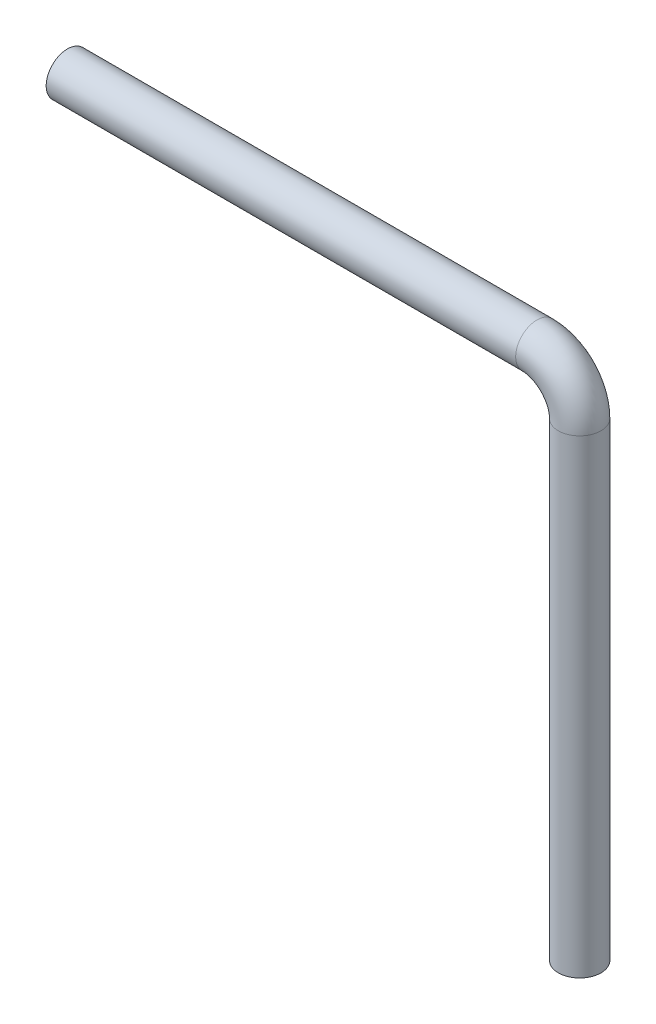
ISO-10303-21;
HEADER;
FILE_DESCRIPTION(('STEP AP214'),'2;1');
FILE_NAME('part.step','',(''),(''),'','','');
FILE_SCHEMA(('AUTOMOTIVE_DESIGN { 1 0 10303 214 1 1 1 1 }'));
ENDSEC;
DATA;
#1=APPLICATION_CONTEXT('core data for automotive mechanical design processes');
#2=APPLICATION_PROTOCOL_DEFINITION('international standard','automotive_design',2000,#1);
#3=PRODUCT_CONTEXT('',#1,'mechanical');
#4=PRODUCT('Part','Part','',(#3));
#5=PRODUCT_RELATED_PRODUCT_CATEGORY('part','',(#4));
#6=PRODUCT_DEFINITION_FORMATION('','',#4);
#7=PRODUCT_DEFINITION_CONTEXT('part definition',#1,'design');
#8=PRODUCT_DEFINITION('design','',#6,#7);
#9=PRODUCT_DEFINITION_SHAPE('','',#8);
#10=(LENGTH_UNIT() NAMED_UNIT(*) SI_UNIT(.MILLI.,.METRE.));
#11=(NAMED_UNIT(*) PLANE_ANGLE_UNIT() SI_UNIT($,.RADIAN.));
#12=(NAMED_UNIT(*) SI_UNIT($,.STERADIAN.) SOLID_ANGLE_UNIT());
#13=UNCERTAINTY_MEASURE_WITH_UNIT(LENGTH_MEASURE(1.E-05),#10,'distance_accuracy_value','');
#14=(GEOMETRIC_REPRESENTATION_CONTEXT(3) GLOBAL_UNCERTAINTY_ASSIGNED_CONTEXT((#13)) GLOBAL_UNIT_ASSIGNED_CONTEXT((#10,
#11,#12)) REPRESENTATION_CONTEXT('',''));
#15=CARTESIAN_POINT('',(0.,0.,0.));
#16=DIRECTION('',(0.,0.,1.));
#17=DIRECTION('',(1.,0.,0.));
#18=AXIS2_PLACEMENT_3D('',#15,#16,#17);
#19=CARTESIAN_POINT('',(-9.99999999999999,0.,0.));
#20=DIRECTION('',(-1.,0.,0.));
#21=DIRECTION('',(0.,-1.,0.));
#22=AXIS2_PLACEMENT_3D('',#19,#20,#21);
#23=CYLINDRICAL_SURFACE('',#22,5.);
#24=CARTESIAN_POINT('',(-9.99999999999999,0.,0.));
#25=DIRECTION('',(-1.,0.,0.));
#26=DIRECTION('',(0.,0.,1.));
#27=AXIS2_PLACEMENT_3D('',#24,#25,#26);
#28=CIRCLE('',#27,5.);
#29=CARTESIAN_POINT('',(-9.99999999999999,5.00000000000002,0.));
#30=VERTEX_POINT('',#29);
#31=EDGE_CURVE('E37',#30,#30,#28,.T.);
#32=ORIENTED_EDGE('',*,*,#31,.T.);
#33=EDGE_LOOP('',(#32));
#34=FACE_BOUND('',#33,.T.);
#35=CARTESIAN_POINT('',(-120.,0.,0.));
#36=DIRECTION('',(-1.,0.,0.));
#37=DIRECTION('',(0.,0.,1.));
#38=AXIS2_PLACEMENT_3D('',#35,#36,#37);
#39=CIRCLE('',#38,5.);
#40=CARTESIAN_POINT('',(-120.,0.,5.));
#41=VERTEX_POINT('',#40);
#42=EDGE_CURVE('E10',#41,#41,#39,.T.);
#43=ORIENTED_EDGE('',*,*,#42,.F.);
#44=EDGE_LOOP('',(#43));
#45=FACE_BOUND('',#44,.T.);
#46=ADVANCED_FACE('F31',(#34,#45),#23,.T.);
#47=CARTESIAN_POINT('',(-9.99999999999999,-9.99999999999997,0.));
#48=DIRECTION('',(0.,0.,1.));
#49=DIRECTION('',(1.,0.,0.));
#50=AXIS2_PLACEMENT_3D('',#47,#48,#49);
#51=TOROIDAL_SURFACE('',#50,9.99999999999999,5.);
#52=CARTESIAN_POINT('',(0.,-9.99999999999997,0.));
#53=DIRECTION('',(0.,1.,0.));
#54=DIRECTION('',(0.,0.,1.));
#55=AXIS2_PLACEMENT_3D('',#52,#53,#54);
#56=CIRCLE('',#55,5.);
#57=CARTESIAN_POINT('',(5.,-9.99999999999997,0.));
#58=VERTEX_POINT('',#57);
#59=EDGE_CURVE('E41',#58,#58,#56,.T.);
#60=CARTESIAN_POINT('',(-9.99999999999999,-9.99999999999997,0.));
#61=DIRECTION('',(0.,0.,1.));
#62=DIRECTION('',(1.,0.,0.));
#63=AXIS2_PLACEMENT_3D('',#60,#61,#62);
#64=CIRCLE('',#63,15.);
#65=EDGE_CURVE('',#58,#30,#64,.T.);
#66=ORIENTED_EDGE('',*,*,#59,.T.);
#67=ORIENTED_EDGE('',*,*,#31,.F.);
#68=ORIENTED_EDGE('',*,*,#65,.T.);
#69=ORIENTED_EDGE('',*,*,#65,.F.);
#70=EDGE_LOOP('',(#66,#68,#67,#69));
#71=FACE_BOUND('',#70,.T.);
#72=ADVANCED_FACE('F63',(#71),#51,.T.);
#73=CARTESIAN_POINT('',(0.,-9.99999999999997,0.));
#74=DIRECTION('',(0.,-1.,0.));
#75=DIRECTION('',(1.,0.,0.));
#76=AXIS2_PLACEMENT_3D('',#73,#74,#75);
#77=CYLINDRICAL_SURFACE('',#76,5.);
#78=ORIENTED_EDGE('',*,*,#59,.F.);
#79=EDGE_LOOP('',(#78));
#80=FACE_BOUND('',#79,.T.);
#81=CARTESIAN_POINT('',(0.,-120.,0.));
#82=DIRECTION('',(0.,1.,0.));
#83=DIRECTION('',(0.,0.,1.));
#84=AXIS2_PLACEMENT_3D('',#81,#82,#83);
#85=CIRCLE('',#84,5.);
#86=CARTESIAN_POINT('',(0.,-120.,5.));
#87=VERTEX_POINT('',#86);
#88=EDGE_CURVE('E45',#87,#87,#85,.T.);
#89=ORIENTED_EDGE('',*,*,#88,.T.);
#90=EDGE_LOOP('',(#89));
#91=FACE_BOUND('',#90,.T.);
#92=ADVANCED_FACE('F51',(#80,#91),#77,.T.);
#93=CARTESIAN_POINT('',(-120.,0.,0.));
#94=DIRECTION('',(-1.,0.,0.));
#95=DIRECTION('',(0.,0.,1.));
#96=AXIS2_PLACEMENT_3D('',#93,#94,#95);
#97=PLANE('',#96);
#98=ORIENTED_EDGE('',*,*,#42,.T.);
#99=EDGE_LOOP('',(#98));
#100=FACE_BOUND('',#99,.T.);
#101=ADVANCED_FACE('F55',(#100),#97,.T.);
#102=CARTESIAN_POINT('',(0.,-120.,0.));
#103=DIRECTION('',(0.,1.,0.));
#104=DIRECTION('',(0.,0.,1.));
#105=AXIS2_PLACEMENT_3D('',#102,#103,#104);
#106=PLANE('',#105);
#107=ORIENTED_EDGE('',*,*,#88,.F.);
#108=EDGE_LOOP('',(#107));
#109=FACE_BOUND('',#108,.T.);
#110=ADVANCED_FACE('F53',(#109),#106,.F.);
#111=CLOSED_SHELL('',(#46,#72,#92,#101,#110));
#112=MANIFOLD_SOLID_BREP('B2',#111);
#113=ADVANCED_BREP_SHAPE_REPRESENTATION('',(#18,#112),#14);
#114=SHAPE_DEFINITION_REPRESENTATION(#9,#113);
ENDSEC;
END-ISO-10303-21;
